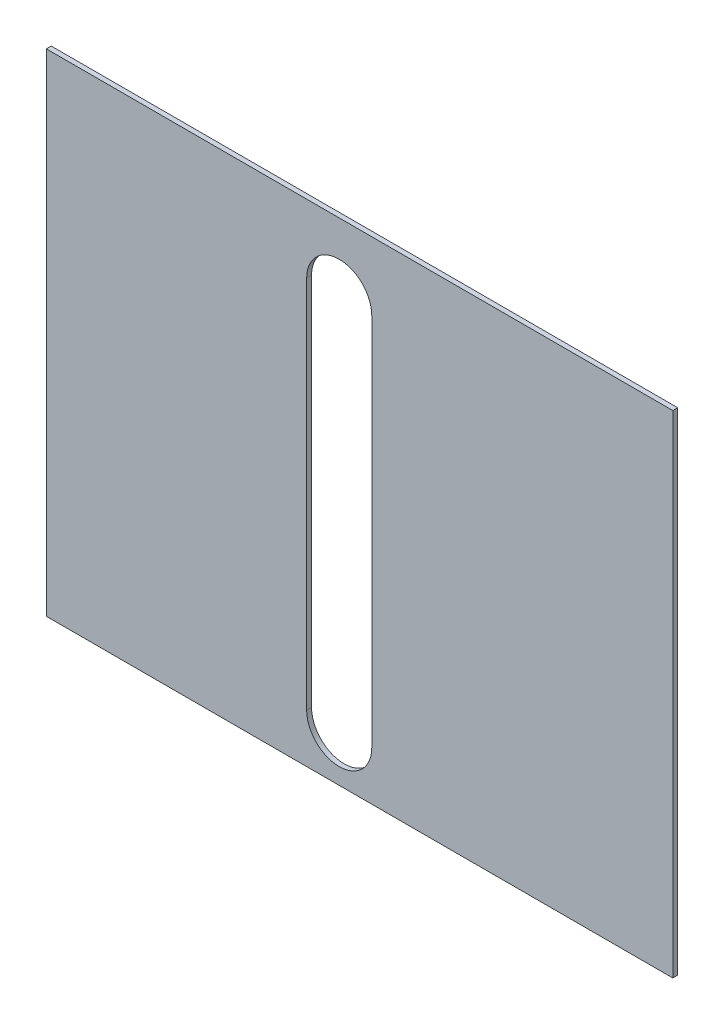
ISO-10303-21;
HEADER;
FILE_DESCRIPTION(('STEP AP214'),'2;1');
FILE_NAME('part.step','',(''),(''),'','','');
FILE_SCHEMA(('AUTOMOTIVE_DESIGN { 1 0 10303 214 1 1 1 1 }'));
ENDSEC;
DATA;
#1=APPLICATION_CONTEXT('core data for automotive mechanical design processes');
#2=APPLICATION_PROTOCOL_DEFINITION('international standard','automotive_design',2000,#1);
#3=PRODUCT_CONTEXT('',#1,'mechanical');
#4=PRODUCT('Part','Part','',(#3));
#5=PRODUCT_RELATED_PRODUCT_CATEGORY('part','',(#4));
#6=PRODUCT_DEFINITION_FORMATION('','',#4);
#7=PRODUCT_DEFINITION_CONTEXT('part definition',#1,'design');
#8=PRODUCT_DEFINITION('design','',#6,#7);
#9=PRODUCT_DEFINITION_SHAPE('','',#8);
#10=(LENGTH_UNIT() NAMED_UNIT(*) SI_UNIT(.MILLI.,.METRE.));
#11=(NAMED_UNIT(*) PLANE_ANGLE_UNIT() SI_UNIT($,.RADIAN.));
#12=(NAMED_UNIT(*) SI_UNIT($,.STERADIAN.) SOLID_ANGLE_UNIT());
#13=UNCERTAINTY_MEASURE_WITH_UNIT(LENGTH_MEASURE(1.E-05),#10,'distance_accuracy_value','');
#14=(GEOMETRIC_REPRESENTATION_CONTEXT(3) GLOBAL_UNCERTAINTY_ASSIGNED_CONTEXT((#13)) GLOBAL_UNIT_ASSIGNED_CONTEXT((#10,
#11,#12)) REPRESENTATION_CONTEXT('',''));
#15=CARTESIAN_POINT('',(0.,0.,0.));
#16=DIRECTION('',(0.,0.,1.));
#17=DIRECTION('',(1.,0.,0.));
#18=AXIS2_PLACEMENT_3D('',#15,#16,#17);
#19=CARTESIAN_POINT('',(0.,0.,3.));
#20=DIRECTION('',(0.,0.,-1.));
#21=DIRECTION('',(-1.,0.,0.));
#22=AXIS2_PLACEMENT_3D('',#19,#20,#21);
#23=PLANE('',#22);
#24=DIRECTION('',(0.,-1.,0.));
#25=VECTOR('',#24,1.);
#26=CARTESIAN_POINT('',(0.,0.,3.));
#27=LINE('',#26,#25);
#28=CARTESIAN_POINT('',(0.,302.,3.));
#29=VERTEX_POINT('',#28);
#30=CARTESIAN_POINT('',(0.,0.,3.));
#31=VERTEX_POINT('',#30);
#32=EDGE_CURVE('E135',#29,#31,#27,.T.);
#33=ORIENTED_EDGE('',*,*,#32,.T.);
#34=DIRECTION('',(1.,0.,0.));
#35=VECTOR('',#34,1.);
#36=CARTESIAN_POINT('',(0.,0.,3.));
#37=LINE('',#36,#35);
#38=CARTESIAN_POINT('',(385.,0.,3.));
#39=VERTEX_POINT('',#38);
#40=EDGE_CURVE('E138',#31,#39,#37,.T.);
#41=ORIENTED_EDGE('',*,*,#40,.T.);
#42=DIRECTION('',(0.,1.,0.));
#43=VECTOR('',#42,1.);
#44=CARTESIAN_POINT('',(385.,0.,3.));
#45=LINE('',#44,#43);
#46=CARTESIAN_POINT('',(385.,302.,3.));
#47=VERTEX_POINT('',#46);
#48=EDGE_CURVE('E141',#39,#47,#45,.T.);
#49=ORIENTED_EDGE('',*,*,#48,.T.);
#50=DIRECTION('',(-1.,0.,0.));
#51=VECTOR('',#50,1.);
#52=CARTESIAN_POINT('',(0.,302.,3.));
#53=LINE('',#52,#51);
#54=EDGE_CURVE('E143',#47,#29,#53,.T.);
#55=ORIENTED_EDGE('',*,*,#54,.T.);
#56=EDGE_LOOP('',(#33,#41,#49,#55));
#57=FACE_BOUND('',#56,.T.);
#58=CARTESIAN_POINT('',(180.,30.,3.));
#59=DIRECTION('',(0.,0.,1.));
#60=DIRECTION('',(1.,0.,0.));
#61=AXIS2_PLACEMENT_3D('',#58,#59,#60);
#62=CIRCLE('',#61,20.);
#63=CARTESIAN_POINT('',(160.,30.,3.));
#64=VERTEX_POINT('',#63);
#65=CARTESIAN_POINT('',(200.,30.,3.));
#66=VERTEX_POINT('',#65);
#67=EDGE_CURVE('E99',#64,#66,#62,.T.);
#68=ORIENTED_EDGE('',*,*,#67,.F.);
#69=DIRECTION('',(0.,-1.,0.));
#70=VECTOR('',#69,1.);
#71=CARTESIAN_POINT('',(160.,30.,3.));
#72=LINE('',#71,#70);
#73=CARTESIAN_POINT('',(160.,260.,3.));
#74=VERTEX_POINT('',#73);
#75=EDGE_CURVE('E121',#74,#64,#72,.T.);
#76=ORIENTED_EDGE('',*,*,#75,.F.);
#77=CARTESIAN_POINT('',(180.,260.,3.));
#78=DIRECTION('',(0.,0.,1.));
#79=DIRECTION('',(1.,0.,0.));
#80=AXIS2_PLACEMENT_3D('',#77,#78,#79);
#81=CIRCLE('',#80,20.);
#82=CARTESIAN_POINT('',(200.,260.,3.));
#83=VERTEX_POINT('',#82);
#84=EDGE_CURVE('E119',#83,#74,#81,.T.);
#85=ORIENTED_EDGE('',*,*,#84,.F.);
#86=DIRECTION('',(0.,1.,0.));
#87=VECTOR('',#86,1.);
#88=CARTESIAN_POINT('',(200.,30.,3.));
#89=LINE('',#88,#87);
#90=EDGE_CURVE('E107',#66,#83,#89,.T.);
#91=ORIENTED_EDGE('',*,*,#90,.F.);
#92=EDGE_LOOP('',(#68,#76,#85,#91));
#93=FACE_BOUND('',#92,.T.);
#94=ADVANCED_FACE('F34',(#57,#93),#23,.F.);
#95=CARTESIAN_POINT('',(0.,0.,0.));
#96=DIRECTION('',(0.,0.,-1.));
#97=DIRECTION('',(-1.,0.,0.));
#98=AXIS2_PLACEMENT_3D('',#95,#96,#97);
#99=PLANE('',#98);
#100=DIRECTION('',(0.,-1.,0.));
#101=VECTOR('',#100,1.);
#102=CARTESIAN_POINT('',(0.,0.,0.));
#103=LINE('',#102,#101);
#104=CARTESIAN_POINT('',(0.,302.,0.));
#105=VERTEX_POINT('',#104);
#106=CARTESIAN_POINT('',(0.,0.,0.));
#107=VERTEX_POINT('',#106);
#108=EDGE_CURVE('E115',#105,#107,#103,.T.);
#109=ORIENTED_EDGE('',*,*,#108,.F.);
#110=DIRECTION('',(-1.,0.,0.));
#111=VECTOR('',#110,1.);
#112=CARTESIAN_POINT('',(0.,302.,0.));
#113=LINE('',#112,#111);
#114=CARTESIAN_POINT('',(385.,302.,0.));
#115=VERTEX_POINT('',#114);
#116=EDGE_CURVE('E139',#115,#105,#113,.T.);
#117=ORIENTED_EDGE('',*,*,#116,.F.);
#118=DIRECTION('',(0.,1.,0.));
#119=VECTOR('',#118,1.);
#120=CARTESIAN_POINT('',(385.,0.,0.));
#121=LINE('',#120,#119);
#122=CARTESIAN_POINT('',(385.,0.,0.));
#123=VERTEX_POINT('',#122);
#124=EDGE_CURVE('E150',#123,#115,#121,.T.);
#125=ORIENTED_EDGE('',*,*,#124,.F.);
#126=DIRECTION('',(1.,0.,0.));
#127=VECTOR('',#126,1.);
#128=CARTESIAN_POINT('',(0.,0.,0.));
#129=LINE('',#128,#127);
#130=EDGE_CURVE('E148',#107,#123,#129,.T.);
#131=ORIENTED_EDGE('',*,*,#130,.F.);
#132=EDGE_LOOP('',(#109,#117,#125,#131));
#133=FACE_BOUND('',#132,.T.);
#134=DIRECTION('',(0.,-1.,0.));
#135=VECTOR('',#134,1.);
#136=CARTESIAN_POINT('',(160.,30.,0.));
#137=LINE('',#136,#135);
#138=CARTESIAN_POINT('',(160.,260.,0.));
#139=VERTEX_POINT('',#138);
#140=CARTESIAN_POINT('',(160.,30.,0.));
#141=VERTEX_POINT('',#140);
#142=EDGE_CURVE('E108',#139,#141,#137,.T.);
#143=ORIENTED_EDGE('',*,*,#142,.T.);
#144=CARTESIAN_POINT('',(180.,30.,0.));
#145=DIRECTION('',(0.,0.,1.));
#146=DIRECTION('',(1.,0.,0.));
#147=AXIS2_PLACEMENT_3D('',#144,#145,#146);
#148=CIRCLE('',#147,20.);
#149=CARTESIAN_POINT('',(200.,30.,0.));
#150=VERTEX_POINT('',#149);
#151=EDGE_CURVE('E57',#141,#150,#148,.T.);
#152=ORIENTED_EDGE('',*,*,#151,.T.);
#153=DIRECTION('',(0.,1.,0.));
#154=VECTOR('',#153,1.);
#155=CARTESIAN_POINT('',(200.,30.,0.));
#156=LINE('',#155,#154);
#157=CARTESIAN_POINT('',(200.,260.,0.));
#158=VERTEX_POINT('',#157);
#159=EDGE_CURVE('E114',#150,#158,#156,.T.);
#160=ORIENTED_EDGE('',*,*,#159,.T.);
#161=CARTESIAN_POINT('',(180.,260.,0.));
#162=DIRECTION('',(0.,0.,1.));
#163=DIRECTION('',(1.,0.,0.));
#164=AXIS2_PLACEMENT_3D('',#161,#162,#163);
#165=CIRCLE('',#164,20.);
#166=EDGE_CURVE('E127',#158,#139,#165,.T.);
#167=ORIENTED_EDGE('',*,*,#166,.T.);
#168=EDGE_LOOP('',(#143,#152,#160,#167));
#169=FACE_BOUND('',#168,.T.);
#170=ADVANCED_FACE('F168',(#133,#169),#99,.T.);
#171=CARTESIAN_POINT('',(0.,0.,3.));
#172=DIRECTION('',(1.,0.,0.));
#173=DIRECTION('',(0.,0.,-1.));
#174=AXIS2_PLACEMENT_3D('',#171,#172,#173);
#175=PLANE('',#174);
#176=ORIENTED_EDGE('',*,*,#108,.T.);
#177=DIRECTION('',(0.,0.,-1.));
#178=VECTOR('',#177,1.);
#179=CARTESIAN_POINT('',(0.,0.,3.));
#180=LINE('',#179,#178);
#181=EDGE_CURVE('E11',#31,#107,#180,.T.);
#182=ORIENTED_EDGE('',*,*,#181,.F.);
#183=ORIENTED_EDGE('',*,*,#32,.F.);
#184=DIRECTION('',(0.,0.,-1.));
#185=VECTOR('',#184,1.);
#186=CARTESIAN_POINT('',(0.,302.,3.));
#187=LINE('',#186,#185);
#188=EDGE_CURVE('E145',#29,#105,#187,.T.);
#189=ORIENTED_EDGE('',*,*,#188,.T.);
#190=EDGE_LOOP('',(#176,#182,#183,#189));
#191=FACE_BOUND('',#190,.T.);
#192=ADVANCED_FACE('F36',(#191),#175,.F.);
#193=CARTESIAN_POINT('',(0.,0.,3.));
#194=DIRECTION('',(0.,1.,0.));
#195=DIRECTION('',(0.,0.,1.));
#196=AXIS2_PLACEMENT_3D('',#193,#194,#195);
#197=PLANE('',#196);
#198=ORIENTED_EDGE('',*,*,#130,.T.);
#199=DIRECTION('',(0.,0.,-1.));
#200=VECTOR('',#199,1.);
#201=CARTESIAN_POINT('',(385.,0.,3.));
#202=LINE('',#201,#200);
#203=EDGE_CURVE('E42',#39,#123,#202,.T.);
#204=ORIENTED_EDGE('',*,*,#203,.F.);
#205=ORIENTED_EDGE('',*,*,#40,.F.);
#206=ORIENTED_EDGE('',*,*,#181,.T.);
#207=EDGE_LOOP('',(#198,#204,#205,#206));
#208=FACE_BOUND('',#207,.T.);
#209=ADVANCED_FACE('F178',(#208),#197,.F.);
#210=CARTESIAN_POINT('',(385.,0.,3.));
#211=DIRECTION('',(-1.,0.,0.));
#212=DIRECTION('',(0.,0.,1.));
#213=AXIS2_PLACEMENT_3D('',#210,#211,#212);
#214=PLANE('',#213);
#215=ORIENTED_EDGE('',*,*,#124,.T.);
#216=DIRECTION('',(0.,0.,-1.));
#217=VECTOR('',#216,1.);
#218=CARTESIAN_POINT('',(385.,302.,3.));
#219=LINE('',#218,#217);
#220=EDGE_CURVE('E155',#47,#115,#219,.T.);
#221=ORIENTED_EDGE('',*,*,#220,.F.);
#222=ORIENTED_EDGE('',*,*,#48,.F.);
#223=ORIENTED_EDGE('',*,*,#203,.T.);
#224=EDGE_LOOP('',(#215,#221,#222,#223));
#225=FACE_BOUND('',#224,.T.);
#226=ADVANCED_FACE('F162',(#225),#214,.F.);
#227=CARTESIAN_POINT('',(0.,302.,3.));
#228=DIRECTION('',(0.,-1.,0.));
#229=DIRECTION('',(0.,0.,-1.));
#230=AXIS2_PLACEMENT_3D('',#227,#228,#229);
#231=PLANE('',#230);
#232=ORIENTED_EDGE('',*,*,#116,.T.);
#233=ORIENTED_EDGE('',*,*,#188,.F.);
#234=ORIENTED_EDGE('',*,*,#54,.F.);
#235=ORIENTED_EDGE('',*,*,#220,.T.);
#236=EDGE_LOOP('',(#232,#233,#234,#235));
#237=FACE_BOUND('',#236,.T.);
#238=ADVANCED_FACE('F172',(#237),#231,.F.);
#239=CARTESIAN_POINT('',(180.,30.,3.));
#240=DIRECTION('',(0.,0.,-1.));
#241=DIRECTION('',(-1.,0.,0.));
#242=AXIS2_PLACEMENT_3D('',#239,#240,#241);
#243=CYLINDRICAL_SURFACE('',#242,20.);
#244=ORIENTED_EDGE('',*,*,#151,.F.);
#245=DIRECTION('',(0.,0.,-1.));
#246=VECTOR('',#245,1.);
#247=CARTESIAN_POINT('',(160.,30.,3.));
#248=LINE('',#247,#246);
#249=EDGE_CURVE('E103',#64,#141,#248,.T.);
#250=ORIENTED_EDGE('',*,*,#249,.F.);
#251=ORIENTED_EDGE('',*,*,#67,.T.);
#252=DIRECTION('',(0.,0.,-1.));
#253=VECTOR('',#252,1.);
#254=CARTESIAN_POINT('',(200.,30.,3.));
#255=LINE('',#254,#253);
#256=EDGE_CURVE('E102',#66,#150,#255,.T.);
#257=ORIENTED_EDGE('',*,*,#256,.T.);
#258=EDGE_LOOP('',(#244,#250,#251,#257));
#259=FACE_BOUND('',#258,.T.);
#260=ADVANCED_FACE('F101',(#259),#243,.F.);
#261=CARTESIAN_POINT('',(200.,30.,3.));
#262=DIRECTION('',(-1.,0.,0.));
#263=DIRECTION('',(0.,0.,1.));
#264=AXIS2_PLACEMENT_3D('',#261,#262,#263);
#265=PLANE('',#264);
#266=ORIENTED_EDGE('',*,*,#159,.F.);
#267=ORIENTED_EDGE('',*,*,#256,.F.);
#268=ORIENTED_EDGE('',*,*,#90,.T.);
#269=DIRECTION('',(0.,0.,-1.));
#270=VECTOR('',#269,1.);
#271=CARTESIAN_POINT('',(200.,260.,3.));
#272=LINE('',#271,#270);
#273=EDGE_CURVE('E116',#83,#158,#272,.T.);
#274=ORIENTED_EDGE('',*,*,#273,.T.);
#275=EDGE_LOOP('',(#266,#267,#268,#274));
#276=FACE_BOUND('',#275,.T.);
#277=ADVANCED_FACE('F111',(#276),#265,.T.);
#278=CARTESIAN_POINT('',(180.,260.,3.));
#279=DIRECTION('',(0.,0.,-1.));
#280=DIRECTION('',(-1.,0.,0.));
#281=AXIS2_PLACEMENT_3D('',#278,#279,#280);
#282=CYLINDRICAL_SURFACE('',#281,20.);
#283=ORIENTED_EDGE('',*,*,#166,.F.);
#284=ORIENTED_EDGE('',*,*,#273,.F.);
#285=ORIENTED_EDGE('',*,*,#84,.T.);
#286=DIRECTION('',(0.,0.,-1.));
#287=VECTOR('',#286,1.);
#288=CARTESIAN_POINT('',(160.,260.,3.));
#289=LINE('',#288,#287);
#290=EDGE_CURVE('E49',#74,#139,#289,.T.);
#291=ORIENTED_EDGE('',*,*,#290,.T.);
#292=EDGE_LOOP('',(#283,#284,#285,#291));
#293=FACE_BOUND('',#292,.T.);
#294=ADVANCED_FACE('F201',(#293),#282,.F.);
#295=CARTESIAN_POINT('',(160.,30.,3.));
#296=DIRECTION('',(1.,0.,0.));
#297=DIRECTION('',(0.,0.,-1.));
#298=AXIS2_PLACEMENT_3D('',#295,#296,#297);
#299=PLANE('',#298);
#300=ORIENTED_EDGE('',*,*,#142,.F.);
#301=ORIENTED_EDGE('',*,*,#290,.F.);
#302=ORIENTED_EDGE('',*,*,#75,.T.);
#303=ORIENTED_EDGE('',*,*,#249,.T.);
#304=EDGE_LOOP('',(#300,#301,#302,#303));
#305=FACE_BOUND('',#304,.T.);
#306=ADVANCED_FACE('F205',(#305),#299,.T.);
#307=CLOSED_SHELL('',(#94,#170,#192,#209,#226,#238,#260,#277,#294,#306));
#308=MANIFOLD_SOLID_BREP('B2',#307);
#309=ADVANCED_BREP_SHAPE_REPRESENTATION('',(#18,#308),#14);
#310=SHAPE_DEFINITION_REPRESENTATION(#9,#309);
ENDSEC;
END-ISO-10303-21;
